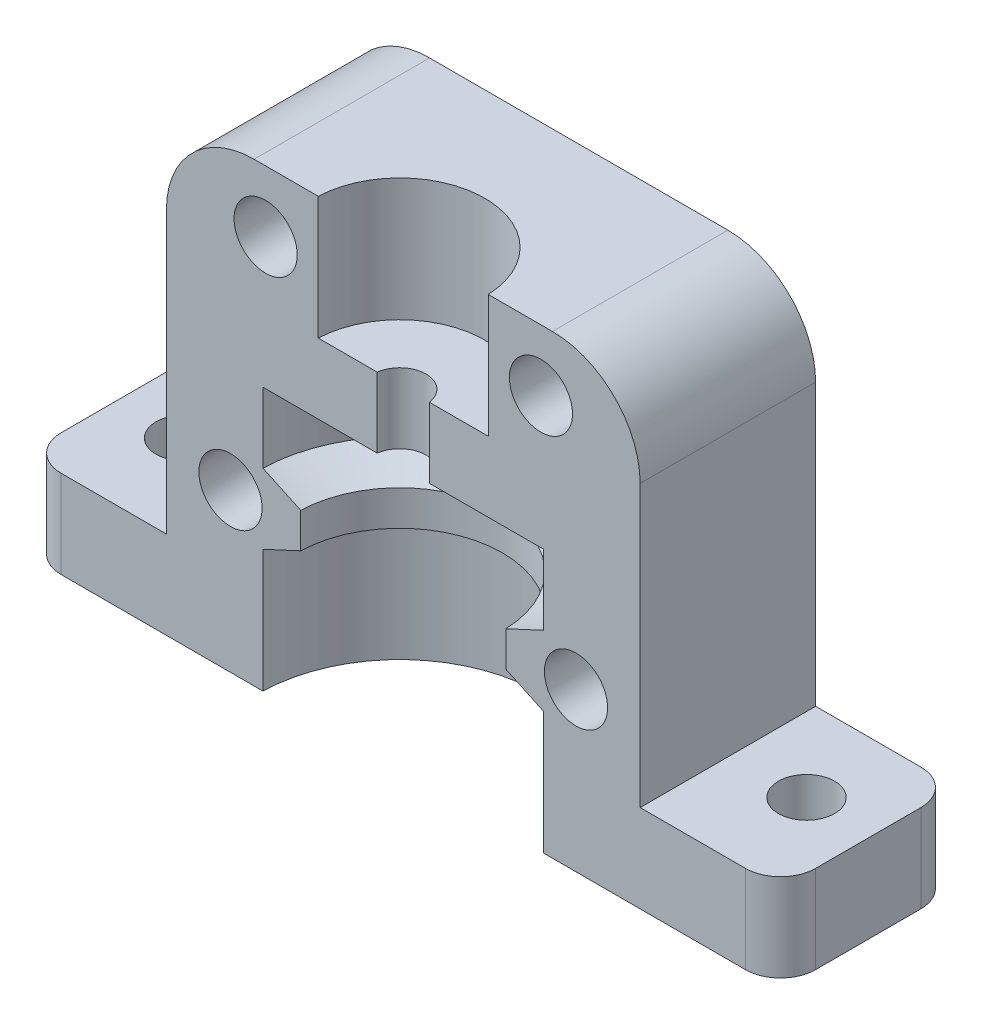
ISO-10303-21;
HEADER;
FILE_DESCRIPTION(('STEP AP214'),'2;1');
FILE_NAME('part.step','',(''),(''),'','','');
FILE_SCHEMA(('AUTOMOTIVE_DESIGN { 1 0 10303 214 1 1 1 1 }'));
ENDSEC;
DATA;
#1=APPLICATION_CONTEXT('core data for automotive mechanical design processes');
#2=APPLICATION_PROTOCOL_DEFINITION('international standard','automotive_design',2000,#1);
#3=PRODUCT_CONTEXT('',#1,'mechanical');
#4=PRODUCT('Part','Part','',(#3));
#5=PRODUCT_RELATED_PRODUCT_CATEGORY('part','',(#4));
#6=PRODUCT_DEFINITION_FORMATION('','',#4);
#7=PRODUCT_DEFINITION_CONTEXT('part definition',#1,'design');
#8=PRODUCT_DEFINITION('design','',#6,#7);
#9=PRODUCT_DEFINITION_SHAPE('','',#8);
#10=(LENGTH_UNIT() NAMED_UNIT(*) SI_UNIT(.MILLI.,.METRE.));
#11=(NAMED_UNIT(*) PLANE_ANGLE_UNIT() SI_UNIT($,.RADIAN.));
#12=(NAMED_UNIT(*) SI_UNIT($,.STERADIAN.) SOLID_ANGLE_UNIT());
#13=UNCERTAINTY_MEASURE_WITH_UNIT(LENGTH_MEASURE(1.E-05),#10,'distance_accuracy_value','');
#14=(GEOMETRIC_REPRESENTATION_CONTEXT(3) GLOBAL_UNCERTAINTY_ASSIGNED_CONTEXT((#13)) GLOBAL_UNIT_ASSIGNED_CONTEXT((#10,
#11,#12)) REPRESENTATION_CONTEXT('',''));
#15=CARTESIAN_POINT('',(0.,0.,0.));
#16=DIRECTION('',(0.,0.,1.));
#17=DIRECTION('',(1.,0.,0.));
#18=AXIS2_PLACEMENT_3D('',#15,#16,#17);
#19=CARTESIAN_POINT('',(-13.5,0.,0.));
#20=DIRECTION('',(0.,1.,0.));
#21=DIRECTION('',(0.,0.,1.));
#22=AXIS2_PLACEMENT_3D('',#19,#20,#21);
#23=PLANE('',#22);
#24=DIRECTION('',(0.,0.,1.));
#25=VECTOR('',#24,1.);
#26=CARTESIAN_POINT('',(-21.5,0.,0.));
#27=LINE('',#26,#25);
#28=CARTESIAN_POINT('',(-21.5,0.,-8.));
#29=VERTEX_POINT('',#28);
#30=CARTESIAN_POINT('',(-21.5,0.,-2.));
#31=VERTEX_POINT('',#30);
#32=EDGE_CURVE('E239',#29,#31,#27,.T.);
#33=ORIENTED_EDGE('',*,*,#32,.F.);
#34=CARTESIAN_POINT('',(-19.5,0.,-8.));
#35=DIRECTION('',(0.,1.,0.));
#36=DIRECTION('',(0.,0.,1.));
#37=AXIS2_PLACEMENT_3D('',#34,#35,#36);
#38=CIRCLE('',#37,2.);
#39=CARTESIAN_POINT('',(-19.5,0.,-10.));
#40=VERTEX_POINT('',#39);
#41=EDGE_CURVE('E305',#29,#40,#38,.F.);
#42=ORIENTED_EDGE('',*,*,#41,.T.);
#43=DIRECTION('',(-1.,0.,0.));
#44=VECTOR('',#43,1.);
#45=CARTESIAN_POINT('',(-13.5,0.,-10.));
#46=LINE('',#45,#44);
#47=CARTESIAN_POINT('',(19.5,0.,-10.));
#48=VERTEX_POINT('',#47);
#49=EDGE_CURVE('E220',#48,#40,#46,.T.);
#50=ORIENTED_EDGE('',*,*,#49,.F.);
#51=CARTESIAN_POINT('',(19.5,0.,-8.));
#52=DIRECTION('',(0.,1.,0.));
#53=DIRECTION('',(0.,0.,1.));
#54=AXIS2_PLACEMENT_3D('',#51,#52,#53);
#55=CIRCLE('',#54,2.);
#56=CARTESIAN_POINT('',(21.5,0.,-8.));
#57=VERTEX_POINT('',#56);
#58=EDGE_CURVE('E304',#48,#57,#55,.F.);
#59=ORIENTED_EDGE('',*,*,#58,.T.);
#60=DIRECTION('',(0.,0.,1.));
#61=VECTOR('',#60,1.);
#62=CARTESIAN_POINT('',(21.5,0.,0.));
#63=LINE('',#62,#61);
#64=CARTESIAN_POINT('',(21.5,0.,-2.));
#65=VERTEX_POINT('',#64);
#66=EDGE_CURVE('E264',#57,#65,#63,.T.);
#67=ORIENTED_EDGE('',*,*,#66,.T.);
#68=CARTESIAN_POINT('',(19.5,0.,-2.));
#69=DIRECTION('',(0.,1.,0.));
#70=DIRECTION('',(0.,0.,1.));
#71=AXIS2_PLACEMENT_3D('',#68,#69,#70);
#72=CIRCLE('',#71,2.);
#73=CARTESIAN_POINT('',(19.5,0.,0.));
#74=VERTEX_POINT('',#73);
#75=EDGE_CURVE('E495',#65,#74,#72,.F.);
#76=ORIENTED_EDGE('',*,*,#75,.T.);
#77=DIRECTION('',(1.,0.,0.));
#78=VECTOR('',#77,1.);
#79=CARTESIAN_POINT('',(-13.5,0.,0.));
#80=LINE('',#79,#78);
#81=CARTESIAN_POINT('',(7.99749960925288,0.,0.));
#82=VERTEX_POINT('',#81);
#83=EDGE_CURVE('E536',#82,#74,#80,.T.);
#84=ORIENTED_EDGE('',*,*,#83,.F.);
#85=CARTESIAN_POINT('',(0.,0.,0.2));
#86=DIRECTION('',(0.,1.,0.));
#87=DIRECTION('',(0.,0.,1.));
#88=AXIS2_PLACEMENT_3D('',#85,#86,#87);
#89=CIRCLE('',#88,8.);
#90=CARTESIAN_POINT('',(-7.99749960925288,0.,0.));
#91=VERTEX_POINT('',#90);
#92=EDGE_CURVE('E546',#82,#91,#89,.T.);
#93=ORIENTED_EDGE('',*,*,#92,.T.);
#94=CARTESIAN_POINT('',(-19.5,0.,0.));
#95=VERTEX_POINT('',#94);
#96=EDGE_CURVE('E535',#95,#91,#80,.T.);
#97=ORIENTED_EDGE('',*,*,#96,.F.);
#98=CARTESIAN_POINT('',(-19.5,0.,-2.));
#99=DIRECTION('',(0.,1.,0.));
#100=DIRECTION('',(0.,0.,1.));
#101=AXIS2_PLACEMENT_3D('',#98,#99,#100);
#102=CIRCLE('',#101,2.);
#103=EDGE_CURVE('E309',#95,#31,#102,.F.);
#104=ORIENTED_EDGE('',*,*,#103,.T.);
#105=EDGE_LOOP('',(#33,#42,#50,#59,#67,#76,#84,#93,#97,#104));
#106=FACE_BOUND('',#105,.T.);
#107=CARTESIAN_POINT('',(17.7373503171622,0.,-5.24426134233362));
#108=DIRECTION('',(0.,-1.,0.));
#109=DIRECTION('',(0.,0.,-1.));
#110=AXIS2_PLACEMENT_3D('',#107,#108,#109);
#111=CIRCLE('',#110,1.60000000000001);
#112=CARTESIAN_POINT('',(17.7373503171622,0.,-6.84426134233363));
#113=VERTEX_POINT('',#112);
#114=EDGE_CURVE('E231',#113,#113,#111,.T.);
#115=ORIENTED_EDGE('',*,*,#114,.F.);
#116=EDGE_LOOP('',(#115));
#117=FACE_BOUND('',#116,.T.);
#118=CARTESIAN_POINT('',(-17.7373503171622,0.,-5.24426134233362));
#119=DIRECTION('',(0.,1.,0.));
#120=DIRECTION('',(0.,0.,-1.));
#121=AXIS2_PLACEMENT_3D('',#118,#119,#120);
#122=CIRCLE('',#121,1.60000000000001);
#123=CARTESIAN_POINT('',(-17.7373503171622,0.,-6.84426134233363));
#124=VERTEX_POINT('',#123);
#125=EDGE_CURVE('E243',#124,#124,#122,.T.);
#126=ORIENTED_EDGE('',*,*,#125,.T.);
#127=EDGE_LOOP('',(#126));
#128=FACE_BOUND('',#127,.T.);
#129=ADVANCED_FACE('F43',(#106,#117,#128),#23,.F.);
#130=CARTESIAN_POINT('',(-13.5,5.,-10.));
#131=DIRECTION('',(0.,-1.,0.));
#132=DIRECTION('',(0.,0.,-1.));
#133=AXIS2_PLACEMENT_3D('',#130,#131,#132);
#134=PLANE('',#133);
#135=DIRECTION('',(-1.,0.,0.));
#136=VECTOR('',#135,1.);
#137=CARTESIAN_POINT('',(-13.5,5.,-10.));
#138=LINE('',#137,#136);
#139=CARTESIAN_POINT('',(-13.5,5.,-10.));
#140=VERTEX_POINT('',#139);
#141=CARTESIAN_POINT('',(-19.5,5.,-10.));
#142=VERTEX_POINT('',#141);
#143=EDGE_CURVE('E223',#140,#142,#138,.T.);
#144=ORIENTED_EDGE('',*,*,#143,.T.);
#145=CARTESIAN_POINT('',(-19.5,5.,-8.));
#146=DIRECTION('',(0.,-1.,0.));
#147=DIRECTION('',(0.,0.,-1.));
#148=AXIS2_PLACEMENT_3D('',#145,#146,#147);
#149=CIRCLE('',#148,2.);
#150=CARTESIAN_POINT('',(-21.5,5.,-8.));
#151=VERTEX_POINT('',#150);
#152=EDGE_CURVE('E314',#142,#151,#149,.F.);
#153=ORIENTED_EDGE('',*,*,#152,.T.);
#154=DIRECTION('',(0.,0.,1.));
#155=VECTOR('',#154,1.);
#156=CARTESIAN_POINT('',(-21.5,5.,0.));
#157=LINE('',#156,#155);
#158=CARTESIAN_POINT('',(-21.5,5.,-2.));
#159=VERTEX_POINT('',#158);
#160=EDGE_CURVE('E232',#151,#159,#157,.T.);
#161=ORIENTED_EDGE('',*,*,#160,.T.);
#162=CARTESIAN_POINT('',(-19.5,5.,-2.));
#163=DIRECTION('',(0.,-1.,0.));
#164=DIRECTION('',(0.,0.,-1.));
#165=AXIS2_PLACEMENT_3D('',#162,#163,#164);
#166=CIRCLE('',#165,2.);
#167=CARTESIAN_POINT('',(-19.5,5.,0.));
#168=VERTEX_POINT('',#167);
#169=EDGE_CURVE('E307',#159,#168,#166,.F.);
#170=ORIENTED_EDGE('',*,*,#169,.T.);
#171=DIRECTION('',(1.,0.,0.));
#172=VECTOR('',#171,1.);
#173=CARTESIAN_POINT('',(-13.5,5.,0.));
#174=LINE('',#173,#172);
#175=CARTESIAN_POINT('',(-13.5,5.,0.));
#176=VERTEX_POINT('',#175);
#177=EDGE_CURVE('E237',#168,#176,#174,.T.);
#178=ORIENTED_EDGE('',*,*,#177,.T.);
#179=DIRECTION('',(0.,0.,-1.));
#180=VECTOR('',#179,1.);
#181=CARTESIAN_POINT('',(-13.5,5.,0.));
#182=LINE('',#181,#180);
#183=EDGE_CURVE('E214',#176,#140,#182,.T.);
#184=ORIENTED_EDGE('',*,*,#183,.T.);
#185=EDGE_LOOP('',(#144,#153,#161,#170,#178,#184));
#186=FACE_BOUND('',#185,.T.);
#187=CARTESIAN_POINT('',(-17.7373503171622,5.,-5.24426134233362));
#188=DIRECTION('',(0.,-1.,0.));
#189=DIRECTION('',(0.,0.,-1.));
#190=AXIS2_PLACEMENT_3D('',#187,#188,#189);
#191=CIRCLE('',#190,1.60000000000001);
#192=CARTESIAN_POINT('',(-17.7373503171622,5.,-6.84426134233363));
#193=VERTEX_POINT('',#192);
#194=EDGE_CURVE('E254',#193,#193,#191,.T.);
#195=ORIENTED_EDGE('',*,*,#194,.T.);
#196=EDGE_LOOP('',(#195));
#197=FACE_BOUND('',#196,.T.);
#198=ADVANCED_FACE('F234',(#186,#197),#134,.F.);
#199=CARTESIAN_POINT('',(-13.5,15.,-10.));
#200=DIRECTION('',(1.,0.,0.));
#201=DIRECTION('',(0.,0.,-1.));
#202=AXIS2_PLACEMENT_3D('',#199,#200,#201);
#203=PLANE('',#202);
#204=DIRECTION('',(0.,-1.,0.));
#205=VECTOR('',#204,1.);
#206=CARTESIAN_POINT('',(-13.5,15.,0.));
#207=LINE('',#206,#205);
#208=CARTESIAN_POINT('',(-13.5,21.,0.));
#209=VERTEX_POINT('',#208);
#210=EDGE_CURVE('E488',#209,#176,#207,.T.);
#211=ORIENTED_EDGE('',*,*,#210,.F.);
#212=DIRECTION('',(0.,0.,1.));
#213=VECTOR('',#212,1.);
#214=CARTESIAN_POINT('',(-13.5,21.,-10.));
#215=LINE('',#214,#213);
#216=CARTESIAN_POINT('',(-13.5,21.,-10.));
#217=VERTEX_POINT('',#216);
#218=EDGE_CURVE('E216',#209,#217,#215,.F.);
#219=ORIENTED_EDGE('',*,*,#218,.T.);
#220=DIRECTION('',(0.,-1.,0.));
#221=VECTOR('',#220,1.);
#222=CARTESIAN_POINT('',(-13.5,15.,-10.));
#223=LINE('',#222,#221);
#224=EDGE_CURVE('E209',#217,#140,#223,.T.);
#225=ORIENTED_EDGE('',*,*,#224,.T.);
#226=ORIENTED_EDGE('',*,*,#183,.F.);
#227=EDGE_LOOP('',(#211,#219,#225,#226));
#228=FACE_BOUND('',#227,.T.);
#229=ADVANCED_FACE('F212',(#228),#203,.F.);
#230=CARTESIAN_POINT('',(-13.5,15.,0.));
#231=DIRECTION('',(0.,0.,-1.));
#232=DIRECTION('',(-1.,0.,0.));
#233=AXIS2_PLACEMENT_3D('',#230,#231,#232);
#234=PLANE('',#233);
#235=CARTESIAN_POINT('',(9.84658019700406,9.,0.));
#236=DIRECTION('',(0.,0.,-1.));
#237=DIRECTION('',(-1.,0.,0.));
#238=AXIS2_PLACEMENT_3D('',#235,#236,#237);
#239=CIRCLE('',#238,1.8);
#240=CARTESIAN_POINT('',(8.04658019700406,9.,0.));
#241=VERTEX_POINT('',#240);
#242=EDGE_CURVE('E397',#241,#241,#239,.T.);
#243=ORIENTED_EDGE('',*,*,#242,.T.);
#244=EDGE_LOOP('',(#243));
#245=FACE_BOUND('',#244,.T.);
#246=ORIENTED_EDGE('',*,*,#83,.T.);
#247=DIRECTION('',(0.,-1.,0.));
#248=VECTOR('',#247,1.);
#249=CARTESIAN_POINT('',(19.5,5.,0.));
#250=LINE('',#249,#248);
#251=CARTESIAN_POINT('',(19.5,5.,0.));
#252=VERTEX_POINT('',#251);
#253=EDGE_CURVE('E12',#74,#252,#250,.F.);
#254=ORIENTED_EDGE('',*,*,#253,.T.);
#255=DIRECTION('',(-1.,0.,0.));
#256=VECTOR('',#255,1.);
#257=CARTESIAN_POINT('',(13.5,5.,0.));
#258=LINE('',#257,#256);
#259=CARTESIAN_POINT('',(13.5,5.,0.));
#260=VERTEX_POINT('',#259);
#261=EDGE_CURVE('E284',#252,#260,#258,.T.);
#262=ORIENTED_EDGE('',*,*,#261,.T.);
#263=DIRECTION('',(0.,-1.,0.));
#264=VECTOR('',#263,1.);
#265=CARTESIAN_POINT('',(13.5,15.,0.));
#266=LINE('',#265,#264);
#267=CARTESIAN_POINT('',(13.5,21.,0.));
#268=VERTEX_POINT('',#267);
#269=EDGE_CURVE('E508',#268,#260,#266,.T.);
#270=ORIENTED_EDGE('',*,*,#269,.F.);
#271=CARTESIAN_POINT('',(8.5,21.,0.));
#272=DIRECTION('',(0.,0.,-1.));
#273=DIRECTION('',(-1.,0.,0.));
#274=AXIS2_PLACEMENT_3D('',#271,#272,#273);
#275=CIRCLE('',#274,5.);
#276=CARTESIAN_POINT('',(8.5,26.,0.));
#277=VERTEX_POINT('',#276);
#278=EDGE_CURVE('E503',#268,#277,#275,.F.);
#279=ORIENTED_EDGE('',*,*,#278,.T.);
#280=DIRECTION('',(1.,0.,0.));
#281=VECTOR('',#280,1.);
#282=CARTESIAN_POINT('',(13.5,26.,0.));
#283=LINE('',#282,#281);
#284=CARTESIAN_POINT('',(4.84587453407535,26.,0.));
#285=VERTEX_POINT('',#284);
#286=EDGE_CURVE('E344',#285,#277,#283,.T.);
#287=ORIENTED_EDGE('',*,*,#286,.F.);
#288=DIRECTION('',(0.,-1.,0.));
#289=VECTOR('',#288,1.);
#290=CARTESIAN_POINT('',(4.84587453407535,26.,0.));
#291=LINE('',#290,#289);
#292=CARTESIAN_POINT('',(4.84587453407535,19.,0.));
#293=VERTEX_POINT('',#292);
#294=EDGE_CURVE('E363',#285,#293,#291,.T.);
#295=ORIENTED_EDGE('',*,*,#294,.T.);
#296=DIRECTION('',(1.,0.,0.));
#297=VECTOR('',#296,1.);
#298=CARTESIAN_POINT('',(13.5,19.,0.));
#299=LINE('',#298,#297);
#300=CARTESIAN_POINT('',(1.48660687473185,19.,0.));
#301=VERTEX_POINT('',#300);
#302=EDGE_CURVE('E378',#301,#293,#299,.T.);
#303=ORIENTED_EDGE('',*,*,#302,.F.);
#304=DIRECTION('',(0.,-1.,0.));
#305=VECTOR('',#304,1.);
#306=CARTESIAN_POINT('',(1.48660687473185,19.,0.));
#307=LINE('',#306,#305);
#308=CARTESIAN_POINT('',(1.48660687473185,15.,0.));
#309=VERTEX_POINT('',#308);
#310=EDGE_CURVE('E400',#301,#309,#307,.T.);
#311=ORIENTED_EDGE('',*,*,#310,.T.);
#312=DIRECTION('',(1.,0.,0.));
#313=VECTOR('',#312,1.);
#314=CARTESIAN_POINT('',(13.5,15.,0.));
#315=LINE('',#314,#313);
#316=CARTESIAN_POINT('',(7.99749960925288,15.,0.));
#317=VERTEX_POINT('',#316);
#318=EDGE_CURVE('E371',#309,#317,#315,.T.);
#319=ORIENTED_EDGE('',*,*,#318,.T.);
#320=DIRECTION('',(0.,1.,0.));
#321=VECTOR('',#320,1.);
#322=CARTESIAN_POINT('',(7.99749960925288,0.,0.));
#323=LINE('',#322,#321);
#324=CARTESIAN_POINT('',(7.99749960925288,11.,0.));
#325=VERTEX_POINT('',#324);
#326=EDGE_CURVE('E545',#317,#325,#323,.F.);
#327=ORIENTED_EDGE('',*,*,#326,.T.);
#328=CARTESIAN_POINT('',(2.13630859371696,8.27704656420469,0.));
#329=CARTESIAN_POINT('',(2.47666423208481,8.43471843957493,0.));
#330=CARTESIAN_POINT('',(2.81694662807883,8.59254819133193,0.));
#331=CARTESIAN_POINT('',(3.49742444253003,8.90839501686628,0.));
#332=CARTESIAN_POINT('',(3.83761986099677,9.06641209062303,0.));
#333=CARTESIAN_POINT('',(4.4960870926516,9.37233230676927,0.));
#334=CARTESIAN_POINT('',(4.81436061243148,9.52023177837934,0.));
#335=CARTESIAN_POINT('',(5.45089092468353,9.81606676258005,0.));
#336=CARTESIAN_POINT('',(5.76914771715483,9.96400227517255,0.));
#337=CARTESIAN_POINT('',(7.10500578331535,10.5849946663086,0.));
#338=CARTESIAN_POINT('',(8.12256957669212,11.0581321615499,0.));
#339=CARTESIAN_POINT('',(10.1576644379378,12.0044770489123,0.));
#340=CARTESIAN_POINT('',(11.1751955058127,12.4776844410207,0.));
#341=CARTESIAN_POINT('',(12.1927355761452,12.9508724589787,0.));
#342=B_SPLINE_CURVE_WITH_KNOTS('',3,(#328,#329,#330,#331,#332,#333,#334,#335,#336,#337,#338,
#339,#340,#341),.UNSPECIFIED.,.F.,.F.,(4,2,2,2,2,2,4),(0.,1.12530931068258,2.25061849754615,
3.3034957911826,4.35637313909035,7.72292277313432,11.0894717975949),.UNSPECIFIED.);
#343=CARTESIAN_POINT('',(5.84658019700406,10.,0.));
#344=VERTEX_POINT('',#343);
#345=EDGE_CURVE('E413',#344,#325,#342,.T.);
#346=ORIENTED_EDGE('',*,*,#345,.F.);
#347=DIRECTION('',(0.,1.,0.));
#348=VECTOR('',#347,1.);
#349=CARTESIAN_POINT('',(5.84658019700406,8.,0.));
#350=LINE('',#349,#348);
#351=CARTESIAN_POINT('',(5.84658019700406,8.,0.));
#352=VERTEX_POINT('',#351);
#353=EDGE_CURVE('E557',#352,#344,#350,.T.);
#354=ORIENTED_EDGE('',*,*,#353,.F.);
#355=CARTESIAN_POINT('',(12.1927355761452,5.04912754102129,0.));
#356=CARTESIAN_POINT('',(11.1751953427723,5.5223155470782,0.));
#357=CARTESIAN_POINT('',(10.1576641621358,5.99552303548821,0.));
#358=CARTESIAN_POINT('',(8.12256933439907,6.94186799496408,0.));
#359=CARTESIAN_POINT('',(7.1050056873013,7.41500546603509,0.));
#360=CARTESIAN_POINT('',(5.75820074929095,8.0410865482715,0.));
#361=CARTESIAN_POINT('',(5.42899669934764,8.19411026138158,0.));
#362=CARTESIAN_POINT('',(4.77057050907102,8.50011873165198,0.));
#363=CARTESIAN_POINT('',(4.44134836873824,8.65310348881343,0.));
#364=CARTESIAN_POINT('',(3.78287676360594,8.95901430342748,0.));
#365=CARTESIAN_POINT('',(3.45362729880392,9.11194036087472,0.));
#366=CARTESIAN_POINT('',(2.79504473693981,9.41761235203759,0.));
#367=CARTESIAN_POINT('',(2.46571163986858,9.57035828573351,0.));
#368=CARTESIAN_POINT('',(2.13630859371698,9.7229534357953,0.));
#369=B_SPLINE_CURVE_WITH_KNOTS('',3,(#355,#356,#357,#358,#359,#360,#361,#362,#363,#364,#365,
#366,#367,#368),.UNSPECIFIED.,.F.,.F.,(4,2,2,2,2,2,4),(0.,3.36654945298723,6.73309865850457,
7.8221918877661,8.91128508569589,10.0003783832144,11.0894717998489),.UNSPECIFIED.);
#370=CARTESIAN_POINT('',(7.99749960925288,7.,0.));
#371=VERTEX_POINT('',#370);
#372=EDGE_CURVE('E404',#371,#352,#369,.T.);
#373=ORIENTED_EDGE('',*,*,#372,.F.);
#374=EDGE_CURVE('E541',#371,#82,#323,.F.);
#375=ORIENTED_EDGE('',*,*,#374,.T.);
#376=EDGE_LOOP('',(#246,#254,#262,#270,#279,#287,#295,#303,#311,#319,#327,#346,#354,#373,#375));
#377=FACE_BOUND('',#376,.T.);
#378=CARTESIAN_POINT('',(7.84587453407535,22.5,0.));
#379=DIRECTION('',(0.,0.,-1.));
#380=DIRECTION('',(-1.,0.,0.));
#381=AXIS2_PLACEMENT_3D('',#378,#379,#380);
#382=CIRCLE('',#381,1.8);
#383=CARTESIAN_POINT('',(6.04587453407535,22.5,0.));
#384=VERTEX_POINT('',#383);
#385=EDGE_CURVE('E288',#384,#384,#382,.T.);
#386=ORIENTED_EDGE('',*,*,#385,.T.);
#387=EDGE_LOOP('',(#386));
#388=FACE_BOUND('',#387,.T.);
#389=ADVANCED_FACE('F421',(#245,#377,#388),#234,.F.);
#390=CARTESIAN_POINT('',(-13.5,15.,-10.));
#391=DIRECTION('',(0.,0.,1.));
#392=DIRECTION('',(1.,0.,0.));
#393=AXIS2_PLACEMENT_3D('',#390,#391,#392);
#394=PLANE('',#393);
#395=CARTESIAN_POINT('',(9.84658019700406,9.,-10.));
#396=DIRECTION('',(0.,0.,-1.));
#397=DIRECTION('',(-1.,0.,0.));
#398=AXIS2_PLACEMENT_3D('',#395,#396,#397);
#399=CIRCLE('',#398,1.8);
#400=CARTESIAN_POINT('',(8.04658019700406,9.,-10.));
#401=VERTEX_POINT('',#400);
#402=EDGE_CURVE('E393',#401,#401,#399,.T.);
#403=ORIENTED_EDGE('',*,*,#402,.F.);
#404=EDGE_LOOP('',(#403));
#405=FACE_BOUND('',#404,.T.);
#406=CARTESIAN_POINT('',(-9.84658019700406,9.,-10.));
#407=DIRECTION('',(0.,0.,1.));
#408=DIRECTION('',(1.,0.,0.));
#409=AXIS2_PLACEMENT_3D('',#406,#407,#408);
#410=CIRCLE('',#409,1.8);
#411=CARTESIAN_POINT('',(-8.04658019700406,9.,-10.));
#412=VERTEX_POINT('',#411);
#413=EDGE_CURVE('E401',#412,#412,#410,.T.);
#414=ORIENTED_EDGE('',*,*,#413,.T.);
#415=EDGE_LOOP('',(#414));
#416=FACE_BOUND('',#415,.T.);
#417=ORIENTED_EDGE('',*,*,#49,.T.);
#418=DIRECTION('',(0.,-1.,0.));
#419=VECTOR('',#418,1.);
#420=CARTESIAN_POINT('',(-19.5,15.,-10.));
#421=LINE('',#420,#419);
#422=EDGE_CURVE('E228',#40,#142,#421,.F.);
#423=ORIENTED_EDGE('',*,*,#422,.T.);
#424=ORIENTED_EDGE('',*,*,#143,.F.);
#425=ORIENTED_EDGE('',*,*,#224,.F.);
#426=CARTESIAN_POINT('',(-8.5,21.,-10.));
#427=DIRECTION('',(0.,0.,1.));
#428=DIRECTION('',(1.,0.,0.));
#429=AXIS2_PLACEMENT_3D('',#426,#427,#428);
#430=CIRCLE('',#429,5.);
#431=CARTESIAN_POINT('',(-8.5,26.,-10.));
#432=VERTEX_POINT('',#431);
#433=EDGE_CURVE('E507',#217,#432,#430,.F.);
#434=ORIENTED_EDGE('',*,*,#433,.T.);
#435=DIRECTION('',(-1.,0.,0.));
#436=VECTOR('',#435,1.);
#437=CARTESIAN_POINT('',(-13.5,26.,-10.));
#438=LINE('',#437,#436);
#439=CARTESIAN_POINT('',(8.5,26.,-10.));
#440=VERTEX_POINT('',#439);
#441=EDGE_CURVE('E347',#440,#432,#438,.T.);
#442=ORIENTED_EDGE('',*,*,#441,.F.);
#443=CARTESIAN_POINT('',(8.5,21.,-10.));
#444=DIRECTION('',(0.,0.,1.));
#445=DIRECTION('',(1.,0.,0.));
#446=AXIS2_PLACEMENT_3D('',#443,#444,#445);
#447=CIRCLE('',#446,5.);
#448=CARTESIAN_POINT('',(13.5,21.,-10.));
#449=VERTEX_POINT('',#448);
#450=EDGE_CURVE('E605',#440,#449,#447,.F.);
#451=ORIENTED_EDGE('',*,*,#450,.T.);
#452=DIRECTION('',(0.,-1.,0.));
#453=VECTOR('',#452,1.);
#454=CARTESIAN_POINT('',(13.5,15.,-10.));
#455=LINE('',#454,#453);
#456=CARTESIAN_POINT('',(13.5,5.,-10.));
#457=VERTEX_POINT('',#456);
#458=EDGE_CURVE('E219',#449,#457,#455,.T.);
#459=ORIENTED_EDGE('',*,*,#458,.T.);
#460=DIRECTION('',(1.,0.,0.));
#461=VECTOR('',#460,1.);
#462=CARTESIAN_POINT('',(13.5,5.,-10.));
#463=LINE('',#462,#461);
#464=CARTESIAN_POINT('',(19.5,5.,-10.));
#465=VERTEX_POINT('',#464);
#466=EDGE_CURVE('E275',#457,#465,#463,.T.);
#467=ORIENTED_EDGE('',*,*,#466,.T.);
#468=DIRECTION('',(0.,-1.,0.));
#469=VECTOR('',#468,1.);
#470=CARTESIAN_POINT('',(19.5,0.,-10.));
#471=LINE('',#470,#469);
#472=EDGE_CURVE('E300',#465,#48,#471,.T.);
#473=ORIENTED_EDGE('',*,*,#472,.T.);
#474=EDGE_LOOP('',(#417,#423,#424,#425,#434,#442,#451,#459,#467,#473));
#475=FACE_BOUND('',#474,.T.);
#476=CARTESIAN_POINT('',(-7.84587453407535,22.5,-10.));
#477=DIRECTION('',(0.,0.,1.));
#478=DIRECTION('',(1.,0.,0.));
#479=AXIS2_PLACEMENT_3D('',#476,#477,#478);
#480=CIRCLE('',#479,1.8);
#481=CARTESIAN_POINT('',(-6.04587453407535,22.5,-10.));
#482=VERTEX_POINT('',#481);
#483=EDGE_CURVE('E335',#482,#482,#480,.T.);
#484=ORIENTED_EDGE('',*,*,#483,.T.);
#485=EDGE_LOOP('',(#484));
#486=FACE_BOUND('',#485,.T.);
#487=CARTESIAN_POINT('',(7.84587453407535,22.5,-10.));
#488=DIRECTION('',(0.,0.,-1.));
#489=DIRECTION('',(-1.,0.,0.));
#490=AXIS2_PLACEMENT_3D('',#487,#488,#489);
#491=CIRCLE('',#490,1.8);
#492=CARTESIAN_POINT('',(6.04587453407535,22.5,-10.));
#493=VERTEX_POINT('',#492);
#494=EDGE_CURVE('E329',#493,#493,#491,.T.);
#495=ORIENTED_EDGE('',*,*,#494,.F.);
#496=EDGE_LOOP('',(#495));
#497=FACE_BOUND('',#496,.T.);
#498=ADVANCED_FACE('F225',(#405,#416,#475,#486,#497),#394,.F.);
#499=CARTESIAN_POINT('',(0.,19.,0.200000000000001));
#500=DIRECTION('',(0.,-1.,0.));
#501=DIRECTION('',(0.,0.,-1.));
#502=AXIS2_PLACEMENT_3D('',#499,#500,#501);
#503=PLANE('',#502);
#504=CARTESIAN_POINT('',(0.,19.,0.200000000000001));
#505=DIRECTION('',(0.,-1.,0.));
#506=DIRECTION('',(0.,0.,-1.));
#507=AXIS2_PLACEMENT_3D('',#504,#505,#506);
#508=CIRCLE('',#507,4.85);
#509=CARTESIAN_POINT('',(-4.84587453407535,19.,0.));
#510=VERTEX_POINT('',#509);
#511=EDGE_CURVE('E338',#510,#293,#508,.T.);
#512=ORIENTED_EDGE('',*,*,#511,.F.);
#513=DIRECTION('',(1.,0.,0.));
#514=VECTOR('',#513,1.);
#515=CARTESIAN_POINT('',(-1.48660687473185,19.,0.));
#516=LINE('',#515,#514);
#517=CARTESIAN_POINT('',(-1.48660687473185,19.,0.));
#518=VERTEX_POINT('',#517);
#519=EDGE_CURVE('E374',#510,#518,#516,.T.);
#520=ORIENTED_EDGE('',*,*,#519,.T.);
#521=CARTESIAN_POINT('',(0.,19.,0.200000000000001));
#522=DIRECTION('',(0.,-1.,0.));
#523=DIRECTION('',(0.,0.,-1.));
#524=AXIS2_PLACEMENT_3D('',#521,#522,#523);
#525=CIRCLE('',#524,1.5);
#526=EDGE_CURVE('E355',#518,#301,#525,.T.);
#527=ORIENTED_EDGE('',*,*,#526,.T.);
#528=ORIENTED_EDGE('',*,*,#302,.T.);
#529=EDGE_LOOP('',(#512,#520,#527,#528));
#530=FACE_BOUND('',#529,.T.);
#531=ADVANCED_FACE('F466',(#530),#503,.F.);
#532=CARTESIAN_POINT('',(0.,0.,0.2));
#533=DIRECTION('',(0.,1.,0.));
#534=DIRECTION('',(0.,0.,1.));
#535=AXIS2_PLACEMENT_3D('',#532,#533,#534);
#536=CYLINDRICAL_SURFACE('',#535,8.);
#537=DIRECTION('',(0.,1.,0.));
#538=VECTOR('',#537,1.);
#539=CARTESIAN_POINT('',(-7.99749960925288,0.,0.));
#540=LINE('',#539,#538);
#541=CARTESIAN_POINT('',(-7.99749960925288,11.,0.));
#542=VERTEX_POINT('',#541);
#543=CARTESIAN_POINT('',(-7.99749960925288,15.,0.));
#544=VERTEX_POINT('',#543);
#545=EDGE_CURVE('E521',#542,#544,#540,.T.);
#546=ORIENTED_EDGE('',*,*,#545,.F.);
#547=CARTESIAN_POINT('',(0.,11.,0.200000000000001));
#548=DIRECTION('',(0.,-1.,0.));
#549=DIRECTION('',(0.,0.,-1.));
#550=AXIS2_PLACEMENT_3D('',#547,#548,#549);
#551=CIRCLE('',#550,8.);
#552=EDGE_CURVE('E446',#542,#325,#551,.T.);
#553=ORIENTED_EDGE('',*,*,#552,.T.);
#554=ORIENTED_EDGE('',*,*,#326,.F.);
#555=CARTESIAN_POINT('',(0.,15.,0.200000000000001));
#556=DIRECTION('',(0.,1.,0.));
#557=DIRECTION('',(0.,0.,1.));
#558=AXIS2_PLACEMENT_3D('',#555,#556,#557);
#559=CIRCLE('',#558,8.);
#560=EDGE_CURVE('E550',#317,#544,#559,.T.);
#561=ORIENTED_EDGE('',*,*,#560,.T.);
#562=EDGE_LOOP('',(#546,#553,#554,#561));
#563=FACE_BOUND('',#562,.T.);
#564=ADVANCED_FACE('F463',(#563),#536,.F.);
#565=CARTESIAN_POINT('',(-7.84587453407535,22.5,0.));
#566=DIRECTION('',(0.,0.,1.));
#567=DIRECTION('',(1.,0.,0.));
#568=AXIS2_PLACEMENT_3D('',#565,#566,#567);
#569=CIRCLE('',#568,1.8);
#570=CARTESIAN_POINT('',(-6.04587453407535,22.5,0.));
#571=VERTEX_POINT('',#570);
#572=EDGE_CURVE('E332',#571,#571,#569,.T.);
#573=ORIENTED_EDGE('',*,*,#572,.F.);
#574=EDGE_LOOP('',(#573));
#575=FACE_BOUND('',#574,.T.);
#576=CARTESIAN_POINT('',(-9.84658019700406,9.,0.));
#577=DIRECTION('',(0.,0.,1.));
#578=DIRECTION('',(1.,0.,0.));
#579=AXIS2_PLACEMENT_3D('',#576,#577,#578);
#580=CIRCLE('',#579,1.8);
#581=CARTESIAN_POINT('',(-8.04658019700406,9.,0.));
#582=VERTEX_POINT('',#581);
#583=EDGE_CURVE('E396',#582,#582,#580,.T.);
#584=ORIENTED_EDGE('',*,*,#583,.F.);
#585=EDGE_LOOP('',(#584));
#586=FACE_BOUND('',#585,.T.);
#587=ORIENTED_EDGE('',*,*,#177,.F.);
#588=DIRECTION('',(0.,-1.,0.));
#589=VECTOR('',#588,1.);
#590=CARTESIAN_POINT('',(-19.5,15.,0.));
#591=LINE('',#590,#589);
#592=EDGE_CURVE('E316',#168,#95,#591,.T.);
#593=ORIENTED_EDGE('',*,*,#592,.T.);
#594=ORIENTED_EDGE('',*,*,#96,.T.);
#595=CARTESIAN_POINT('',(-7.99749960925288,7.,0.));
#596=VERTEX_POINT('',#595);
#597=EDGE_CURVE('E537',#91,#596,#540,.T.);
#598=ORIENTED_EDGE('',*,*,#597,.T.);
#599=CARTESIAN_POINT('',(-13.5694710976632,4.40886283050069,0.));
#600=CARTESIAN_POINT('',(-13.0607075623458,4.64547104003702,0.));
#601=CARTESIAN_POINT('',(-12.5519431312939,4.88207732367614,0.));
#602=CARTESIAN_POINT('',(-11.5344110769824,5.35528297306801,0.));
#603=CARTESIAN_POINT('',(-11.0256434537229,5.59188233882104,0.));
#604=CARTESIAN_POINT('',(-10.0081036317402,6.0650710782205,0.));
#605=CARTESIAN_POINT('',(-9.49933143301761,6.30166045186808,0.));
#606=CARTESIAN_POINT('',(-8.481779674769,6.77482342219577,0.));
#607=CARTESIAN_POINT('',(-7.97300011524274,7.01139701887525,0.));
#608=CARTESIAN_POINT('',(-6.95542795403731,7.48451646442214,0.));
#609=CARTESIAN_POINT('',(-6.44663535235521,7.72106231328321,0.));
#610=CARTESIAN_POINT('',(-5.42902616974135,8.19410230095601,0.));
#611=CARTESIAN_POINT('',(-4.920209588812,8.43059643977289,0.));
#612=CARTESIAN_POINT('',(-4.15693951038571,8.78524064845345,0.));
#613=CARTESIAN_POINT('',(-3.90250856147982,8.9034392435928,0.));
#614=CARTESIAN_POINT('',(-3.39361926921941,9.13977734977291,0.));
#615=CARTESIAN_POINT('',(-3.13916092586904,9.25791686082263,0.));
#616=CARTESIAN_POINT('',(-2.63019130681356,9.49408221653571,0.));
#617=CARTESIAN_POINT('',(-2.37568003107938,9.61210806113644,0.));
#618=CARTESIAN_POINT('',(-1.99381601002154,9.78893745506795,0.));
#619=CARTESIAN_POINT('',(-1.86651178190087,9.84784570774863,0.));
#620=CARTESIAN_POINT('',(-1.61183587592353,9.96551636455164,0.));
#621=CARTESIAN_POINT('',(-1.48446419803226,10.024278768599,0.));
#622=CARTESIAN_POINT('',(-1.35704130817498,10.0829301949044,0.));
#623=B_SPLINE_CURVE_WITH_KNOTS('',3,(#599,#600,#601,#602,#603,#604,#605,#606,#607,#608,#609,
#610,#611,#612,#613,#614,#615,#616,#617,#618,#619,#620,#621,#622),.UNSPECIFIED.,.F.,.F.,(4,2,2,
2,2,2,2,2,2,2,2,4),(0.,1.68327478966497,3.366549511425,5.04982403953433,6.73309863361752,
8.41637361127464,10.0996484211946,10.9412861894982,11.7829238302033,12.6245619343962,
13.0453812278782,13.4662007375097),.UNSPECIFIED.);
#624=CARTESIAN_POINT('',(-5.84658019700406,8.,0.));
#625=VERTEX_POINT('',#624);
#626=EDGE_CURVE('E440',#596,#625,#623,.T.);
#627=ORIENTED_EDGE('',*,*,#626,.T.);
#628=DIRECTION('',(0.,1.,0.));
#629=VECTOR('',#628,1.);
#630=CARTESIAN_POINT('',(-5.84658019700406,8.,0.));
#631=LINE('',#630,#629);
#632=CARTESIAN_POINT('',(-5.84658019700406,10.,0.));
#633=VERTEX_POINT('',#632);
#634=EDGE_CURVE('E552',#625,#633,#631,.T.);
#635=ORIENTED_EDGE('',*,*,#634,.T.);
#636=CARTESIAN_POINT('',(-1.35704130817498,7.91706980509557,0.));
#637=CARTESIAN_POINT('',(-1.46595975829712,7.96719943468217,0.));
#638=CARTESIAN_POINT('',(-1.57483882299266,8.01741445097508,0.));
#639=CARTESIAN_POINT('',(-1.79254329865238,8.11796053959665,0.));
#640=CARTESIAN_POINT('',(-1.90136870964311,8.16829161186781,0.));
#641=CARTESIAN_POINT('',(-2.2278021905029,8.31937686088671,0.));
#642=CARTESIAN_POINT('',(-2.44536761730344,8.42022312016,0.));
#643=CARTESIAN_POINT('',(-3.06314649128176,8.70675368077935,0.));
#644=CARTESIAN_POINT('',(-3.46330325335294,8.89256014734099,0.));
#645=CARTESIAN_POINT('',(-4.26356520752686,9.26428404638546,0.));
#646=CARTESIAN_POINT('',(-4.66367039962976,9.45020147886794,0.));
#647=CARTESIAN_POINT('',(-5.86395037453705,10.0080321355048,0.));
#648=CARTESIAN_POINT('',(-6.66408888555472,10.3800234074987,0.));
#649=CARTESIAN_POINT('',(-8.48178572627477,11.2251653310499,0.));
#650=CARTESIAN_POINT('',(-9.49933584227692,11.6983336434773,0.));
#651=CARTESIAN_POINT('',(-11.5344140755056,12.6447142565933,0.));
#652=CARTESIAN_POINT('',(-12.551942192758,13.1179265572263,0.));
#653=CARTESIAN_POINT('',(-13.5694710976632,13.5911371694993,0.));
#654=B_SPLINE_CURVE_WITH_KNOTS('',3,(#636,#637,#638,#639,#640,#641,#642,#643,#644,#645,#646,
#647,#648,#649,#650,#651,#652,#653),.UNSPECIFIED.,.F.,.F.,(4,2,2,2,2,2,2,2,4),(0.,
0.35970233647756,0.719404494770601,1.43880845107362,2.76238131368953,4.08595417223746,
6.73310210680843,10.0996535222429,13.4662007398885),.UNSPECIFIED.);
#655=EDGE_CURVE('E435',#633,#542,#654,.T.);
#656=ORIENTED_EDGE('',*,*,#655,.T.);
#657=ORIENTED_EDGE('',*,*,#545,.T.);
#658=DIRECTION('',(1.,0.,0.));
#659=VECTOR('',#658,1.);
#660=CARTESIAN_POINT('',(-1.48660687473185,15.,0.));
#661=LINE('',#660,#659);
#662=CARTESIAN_POINT('',(-1.48660687473185,15.,0.));
#663=VERTEX_POINT('',#662);
#664=EDGE_CURVE('E391',#544,#663,#661,.T.);
#665=ORIENTED_EDGE('',*,*,#664,.T.);
#666=DIRECTION('',(0.,-1.,0.));
#667=VECTOR('',#666,1.);
#668=CARTESIAN_POINT('',(-1.48660687473185,19.,0.));
#669=LINE('',#668,#667);
#670=EDGE_CURVE('E377',#518,#663,#669,.T.);
#671=ORIENTED_EDGE('',*,*,#670,.F.);
#672=ORIENTED_EDGE('',*,*,#519,.F.);
#673=DIRECTION('',(0.,-1.,0.));
#674=VECTOR('',#673,1.);
#675=CARTESIAN_POINT('',(-4.84587453407535,26.,0.));
#676=LINE('',#675,#674);
#677=CARTESIAN_POINT('',(-4.84587453407535,26.,0.));
#678=VERTEX_POINT('',#677);
#679=EDGE_CURVE('E352',#678,#510,#676,.T.);
#680=ORIENTED_EDGE('',*,*,#679,.F.);
#681=DIRECTION('',(1.,0.,0.));
#682=VECTOR('',#681,1.);
#683=CARTESIAN_POINT('',(-4.84587453407535,26.,0.));
#684=LINE('',#683,#682);
#685=CARTESIAN_POINT('',(-8.5,26.,0.));
#686=VERTEX_POINT('',#685);
#687=EDGE_CURVE('E350',#686,#678,#684,.T.);
#688=ORIENTED_EDGE('',*,*,#687,.F.);
#689=CARTESIAN_POINT('',(-8.5,21.,0.));
#690=DIRECTION('',(0.,0.,-1.));
#691=DIRECTION('',(-1.,0.,0.));
#692=AXIS2_PLACEMENT_3D('',#689,#690,#691);
#693=CIRCLE('',#692,5.);
#694=EDGE_CURVE('E529',#686,#209,#693,.F.);
#695=ORIENTED_EDGE('',*,*,#694,.T.);
#696=ORIENTED_EDGE('',*,*,#210,.T.);
#697=EDGE_LOOP('',(#587,#593,#594,#598,#627,#635,#656,#657,#665,#671,#672,#680,#688,#695,#696));
#698=FACE_BOUND('',#697,.T.);
#699=ADVANCED_FACE('F427',(#575,#586,#698),#234,.F.);
#700=CARTESIAN_POINT('',(13.5,15.,-10.));
#701=DIRECTION('',(-1.,0.,0.));
#702=DIRECTION('',(0.,0.,1.));
#703=AXIS2_PLACEMENT_3D('',#700,#701,#702);
#704=PLANE('',#703);
#705=ORIENTED_EDGE('',*,*,#458,.F.);
#706=DIRECTION('',(0.,0.,-1.));
#707=VECTOR('',#706,1.);
#708=CARTESIAN_POINT('',(13.5,21.,-10.));
#709=LINE('',#708,#707);
#710=EDGE_CURVE('E505',#449,#268,#709,.F.);
#711=ORIENTED_EDGE('',*,*,#710,.T.);
#712=ORIENTED_EDGE('',*,*,#269,.T.);
#713=DIRECTION('',(0.,0.,-1.));
#714=VECTOR('',#713,1.);
#715=CARTESIAN_POINT('',(13.5,5.,0.));
#716=LINE('',#715,#714);
#717=EDGE_CURVE('E270',#260,#457,#716,.T.);
#718=ORIENTED_EDGE('',*,*,#717,.T.);
#719=EDGE_LOOP('',(#705,#711,#712,#718));
#720=FACE_BOUND('',#719,.T.);
#721=ADVANCED_FACE('F428',(#720),#704,.F.);
#722=ORIENTED_EDGE('',*,*,#374,.F.);
#723=CARTESIAN_POINT('',(0.,7.,0.200000000000001));
#724=DIRECTION('',(0.,-1.,0.));
#725=DIRECTION('',(0.,0.,-1.));
#726=AXIS2_PLACEMENT_3D('',#723,#724,#725);
#727=CIRCLE('',#726,8.);
#728=EDGE_CURVE('E570',#596,#371,#727,.T.);
#729=ORIENTED_EDGE('',*,*,#728,.F.);
#730=ORIENTED_EDGE('',*,*,#597,.F.);
#731=ORIENTED_EDGE('',*,*,#92,.F.);
#732=EDGE_LOOP('',(#722,#729,#730,#731));
#733=FACE_BOUND('',#732,.T.);
#734=ADVANCED_FACE('F458',(#733),#536,.F.);
#735=CARTESIAN_POINT('',(0.,8.,0.200000000000001));
#736=DIRECTION('',(0.,1.,0.));
#737=DIRECTION('',(0.,0.,1.));
#738=AXIS2_PLACEMENT_3D('',#735,#736,#737);
#739=CYLINDRICAL_SURFACE('',#738,5.85);
#740=CARTESIAN_POINT('',(0.,10.,0.200000000000001));
#741=DIRECTION('',(0.,-1.,0.));
#742=DIRECTION('',(0.,0.,-1.));
#743=AXIS2_PLACEMENT_3D('',#740,#741,#742);
#744=CIRCLE('',#743,5.85);
#745=EDGE_CURVE('E565',#633,#344,#744,.T.);
#746=ORIENTED_EDGE('',*,*,#745,.F.);
#747=ORIENTED_EDGE('',*,*,#634,.F.);
#748=CARTESIAN_POINT('',(0.,8.,0.200000000000001));
#749=DIRECTION('',(0.,-1.,0.));
#750=DIRECTION('',(0.,0.,-1.));
#751=AXIS2_PLACEMENT_3D('',#748,#749,#750);
#752=CIRCLE('',#751,5.85);
#753=EDGE_CURVE('E562',#625,#352,#752,.T.);
#754=ORIENTED_EDGE('',*,*,#753,.T.);
#755=ORIENTED_EDGE('',*,*,#353,.T.);
#756=EDGE_LOOP('',(#746,#747,#754,#755));
#757=FACE_BOUND('',#756,.T.);
#758=ADVANCED_FACE('F455',(#757),#739,.F.);
#759=CARTESIAN_POINT('',(0.,11.,0.200000000000001));
#760=DIRECTION('',(0.,1.,0.));
#761=DIRECTION('',(0.,0.,1.));
#762=AXIS2_PLACEMENT_3D('',#759,#760,#761);
#763=CONICAL_SURFACE('',#762,8.,1.13544305164259);
#764=ORIENTED_EDGE('',*,*,#655,.F.);
#765=ORIENTED_EDGE('',*,*,#745,.T.);
#766=ORIENTED_EDGE('',*,*,#345,.T.);
#767=ORIENTED_EDGE('',*,*,#552,.F.);
#768=EDGE_LOOP('',(#764,#765,#766,#767));
#769=FACE_BOUND('',#768,.T.);
#770=ADVANCED_FACE('F452',(#769),#763,.F.);
#771=CARTESIAN_POINT('',(0.,8.,0.200000000000001));
#772=DIRECTION('',(0.,-1.,0.));
#773=DIRECTION('',(0.,0.,-1.));
#774=AXIS2_PLACEMENT_3D('',#771,#772,#773);
#775=CONICAL_SURFACE('',#774,5.85,1.1354430516426);
#776=ORIENTED_EDGE('',*,*,#626,.F.);
#777=ORIENTED_EDGE('',*,*,#728,.T.);
#778=ORIENTED_EDGE('',*,*,#372,.T.);
#779=ORIENTED_EDGE('',*,*,#753,.F.);
#780=EDGE_LOOP('',(#776,#777,#778,#779));
#781=FACE_BOUND('',#780,.T.);
#782=ADVANCED_FACE('F447',(#781),#775,.F.);
#783=CARTESIAN_POINT('',(-9.84658019700406,9.,-10.));
#784=DIRECTION('',(0.,0.,1.));
#785=DIRECTION('',(1.,0.,0.));
#786=AXIS2_PLACEMENT_3D('',#783,#784,#785);
#787=CYLINDRICAL_SURFACE('',#786,1.8);
#788=ORIENTED_EDGE('',*,*,#413,.F.);
#789=EDGE_LOOP('',(#788));
#790=FACE_BOUND('',#789,.T.);
#791=ORIENTED_EDGE('',*,*,#583,.T.);
#792=EDGE_LOOP('',(#791));
#793=FACE_BOUND('',#792,.T.);
#794=ADVANCED_FACE('F451',(#790,#793),#787,.F.);
#795=CARTESIAN_POINT('',(9.84658019700406,9.,-10.));
#796=DIRECTION('',(0.,0.,1.));
#797=DIRECTION('',(1.,0.,0.));
#798=AXIS2_PLACEMENT_3D('',#795,#796,#797);
#799=CYLINDRICAL_SURFACE('',#798,1.8);
#800=ORIENTED_EDGE('',*,*,#402,.T.);
#801=EDGE_LOOP('',(#800));
#802=FACE_BOUND('',#801,.T.);
#803=ORIENTED_EDGE('',*,*,#242,.F.);
#804=EDGE_LOOP('',(#803));
#805=FACE_BOUND('',#804,.T.);
#806=ADVANCED_FACE('F479',(#802,#805),#799,.F.);
#807=CARTESIAN_POINT('',(0.,15.,0.200000000000001));
#808=DIRECTION('',(0.,-1.,0.));
#809=DIRECTION('',(0.,0.,-1.));
#810=AXIS2_PLACEMENT_3D('',#807,#808,#809);
#811=PLANE('',#810);
#812=ORIENTED_EDGE('',*,*,#560,.F.);
#813=ORIENTED_EDGE('',*,*,#318,.F.);
#814=CARTESIAN_POINT('',(0.,15.,0.200000000000001));
#815=DIRECTION('',(0.,-1.,0.));
#816=DIRECTION('',(0.,0.,-1.));
#817=AXIS2_PLACEMENT_3D('',#814,#815,#816);
#818=CIRCLE('',#817,1.5);
#819=EDGE_CURVE('E368',#663,#309,#818,.T.);
#820=ORIENTED_EDGE('',*,*,#819,.F.);
#821=ORIENTED_EDGE('',*,*,#664,.F.);
#822=EDGE_LOOP('',(#812,#813,#820,#821));
#823=FACE_BOUND('',#822,.T.);
#824=ADVANCED_FACE('F592',(#823),#811,.T.);
#825=CARTESIAN_POINT('',(0.,19.,0.200000000000001));
#826=DIRECTION('',(0.,-1.,0.));
#827=DIRECTION('',(0.,0.,-1.));
#828=AXIS2_PLACEMENT_3D('',#825,#826,#827);
#829=CYLINDRICAL_SURFACE('',#828,1.5);
#830=ORIENTED_EDGE('',*,*,#819,.T.);
#831=ORIENTED_EDGE('',*,*,#310,.F.);
#832=ORIENTED_EDGE('',*,*,#526,.F.);
#833=ORIENTED_EDGE('',*,*,#670,.T.);
#834=EDGE_LOOP('',(#830,#831,#832,#833));
#835=FACE_BOUND('',#834,.T.);
#836=ADVANCED_FACE('F589',(#835),#829,.F.);
#837=CARTESIAN_POINT('',(0.,26.,0.200000000000001));
#838=DIRECTION('',(0.,-1.,0.));
#839=DIRECTION('',(0.,0.,-1.));
#840=AXIS2_PLACEMENT_3D('',#837,#838,#839);
#841=CYLINDRICAL_SURFACE('',#840,4.85);
#842=ORIENTED_EDGE('',*,*,#511,.T.);
#843=ORIENTED_EDGE('',*,*,#294,.F.);
#844=CARTESIAN_POINT('',(0.,26.,0.200000000000001));
#845=DIRECTION('',(0.,-1.,0.));
#846=DIRECTION('',(0.,0.,-1.));
#847=AXIS2_PLACEMENT_3D('',#844,#845,#846);
#848=CIRCLE('',#847,4.85);
#849=EDGE_CURVE('E341',#678,#285,#848,.T.);
#850=ORIENTED_EDGE('',*,*,#849,.F.);
#851=ORIENTED_EDGE('',*,*,#679,.T.);
#852=EDGE_LOOP('',(#842,#843,#850,#851));
#853=FACE_BOUND('',#852,.T.);
#854=ADVANCED_FACE('F594',(#853),#841,.F.);
#855=CARTESIAN_POINT('',(0.,26.,0.200000000000001));
#856=DIRECTION('',(0.,-1.,0.));
#857=DIRECTION('',(0.,0.,-1.));
#858=AXIS2_PLACEMENT_3D('',#855,#856,#857);
#859=PLANE('',#858);
#860=ORIENTED_EDGE('',*,*,#441,.T.);
#861=DIRECTION('',(0.,0.,1.));
#862=VECTOR('',#861,1.);
#863=CARTESIAN_POINT('',(-8.5,26.,0.199999999999999));
#864=LINE('',#863,#862);
#865=EDGE_CURVE('E528',#432,#686,#864,.T.);
#866=ORIENTED_EDGE('',*,*,#865,.T.);
#867=ORIENTED_EDGE('',*,*,#687,.T.);
#868=ORIENTED_EDGE('',*,*,#849,.T.);
#869=ORIENTED_EDGE('',*,*,#286,.T.);
#870=DIRECTION('',(0.,0.,-1.));
#871=VECTOR('',#870,1.);
#872=CARTESIAN_POINT('',(8.5,26.,0.199999999999999));
#873=LINE('',#872,#871);
#874=EDGE_CURVE('E527',#277,#440,#873,.T.);
#875=ORIENTED_EDGE('',*,*,#874,.T.);
#876=EDGE_LOOP('',(#860,#866,#867,#868,#869,#875));
#877=FACE_BOUND('',#876,.T.);
#878=ADVANCED_FACE('F596',(#877),#859,.F.);
#879=CARTESIAN_POINT('',(-7.84587453407535,22.5,-10.));
#880=DIRECTION('',(0.,0.,1.));
#881=DIRECTION('',(1.,0.,0.));
#882=AXIS2_PLACEMENT_3D('',#879,#880,#881);
#883=CYLINDRICAL_SURFACE('',#882,1.8);
#884=ORIENTED_EDGE('',*,*,#483,.F.);
#885=EDGE_LOOP('',(#884));
#886=FACE_BOUND('',#885,.T.);
#887=ORIENTED_EDGE('',*,*,#572,.T.);
#888=EDGE_LOOP('',(#887));
#889=FACE_BOUND('',#888,.T.);
#890=ADVANCED_FACE('F665',(#886,#889),#883,.F.);
#891=CARTESIAN_POINT('',(7.84587453407535,22.5,-10.));
#892=DIRECTION('',(0.,0.,1.));
#893=DIRECTION('',(1.,0.,0.));
#894=AXIS2_PLACEMENT_3D('',#891,#892,#893);
#895=CYLINDRICAL_SURFACE('',#894,1.8);
#896=ORIENTED_EDGE('',*,*,#494,.T.);
#897=EDGE_LOOP('',(#896));
#898=FACE_BOUND('',#897,.T.);
#899=ORIENTED_EDGE('',*,*,#385,.F.);
#900=EDGE_LOOP('',(#899));
#901=FACE_BOUND('',#900,.T.);
#902=ADVANCED_FACE('F662',(#898,#901),#895,.F.);
#903=CARTESIAN_POINT('',(21.5,5.,0.));
#904=DIRECTION('',(1.,0.,0.));
#905=DIRECTION('',(0.,0.,-1.));
#906=AXIS2_PLACEMENT_3D('',#903,#904,#905);
#907=PLANE('',#906);
#908=ORIENTED_EDGE('',*,*,#66,.F.);
#909=DIRECTION('',(0.,-1.,0.));
#910=VECTOR('',#909,1.);
#911=CARTESIAN_POINT('',(21.5,5.,-8.));
#912=LINE('',#911,#910);
#913=CARTESIAN_POINT('',(21.5,5.,-8.));
#914=VERTEX_POINT('',#913);
#915=EDGE_CURVE('E289',#57,#914,#912,.F.);
#916=ORIENTED_EDGE('',*,*,#915,.T.);
#917=DIRECTION('',(0.,0.,1.));
#918=VECTOR('',#917,1.);
#919=CARTESIAN_POINT('',(21.5,5.,0.));
#920=LINE('',#919,#918);
#921=CARTESIAN_POINT('',(21.5,5.,-2.));
#922=VERTEX_POINT('',#921);
#923=EDGE_CURVE('E267',#914,#922,#920,.T.);
#924=ORIENTED_EDGE('',*,*,#923,.T.);
#925=DIRECTION('',(0.,-1.,0.));
#926=VECTOR('',#925,1.);
#927=CARTESIAN_POINT('',(21.5,0.,-2.));
#928=LINE('',#927,#926);
#929=EDGE_CURVE('E318',#922,#65,#928,.T.);
#930=ORIENTED_EDGE('',*,*,#929,.T.);
#931=EDGE_LOOP('',(#908,#916,#924,#930));
#932=FACE_BOUND('',#931,.T.);
#933=ADVANCED_FACE('F326',(#932),#907,.T.);
#934=CARTESIAN_POINT('',(13.5,5.,-10.));
#935=DIRECTION('',(0.,-1.,0.));
#936=DIRECTION('',(0.,0.,-1.));
#937=AXIS2_PLACEMENT_3D('',#934,#935,#936);
#938=PLANE('',#937);
#939=CARTESIAN_POINT('',(17.7373503171622,5.,-5.24426134233362));
#940=DIRECTION('',(0.,-1.,0.));
#941=DIRECTION('',(0.,0.,-1.));
#942=AXIS2_PLACEMENT_3D('',#939,#940,#941);
#943=CIRCLE('',#942,1.60000000000001);
#944=CARTESIAN_POINT('',(17.7373503171622,5.,-6.84426134233363));
#945=VERTEX_POINT('',#944);
#946=EDGE_CURVE('E260',#945,#945,#943,.F.);
#947=ORIENTED_EDGE('',*,*,#946,.F.);
#948=EDGE_LOOP('',(#947));
#949=FACE_BOUND('',#948,.T.);
#950=ORIENTED_EDGE('',*,*,#923,.F.);
#951=CARTESIAN_POINT('',(19.5,5.,-8.));
#952=DIRECTION('',(0.,-1.,0.));
#953=DIRECTION('',(0.,0.,-1.));
#954=AXIS2_PLACEMENT_3D('',#951,#952,#953);
#955=CIRCLE('',#954,2.);
#956=EDGE_CURVE('E52',#914,#465,#955,.F.);
#957=ORIENTED_EDGE('',*,*,#956,.T.);
#958=ORIENTED_EDGE('',*,*,#466,.F.);
#959=ORIENTED_EDGE('',*,*,#717,.F.);
#960=ORIENTED_EDGE('',*,*,#261,.F.);
#961=CARTESIAN_POINT('',(19.5,5.,-2.));
#962=DIRECTION('',(0.,-1.,0.));
#963=DIRECTION('',(0.,0.,-1.));
#964=AXIS2_PLACEMENT_3D('',#961,#962,#963);
#965=CIRCLE('',#964,2.);
#966=EDGE_CURVE('E67',#252,#922,#965,.F.);
#967=ORIENTED_EDGE('',*,*,#966,.T.);
#968=EDGE_LOOP('',(#950,#957,#958,#959,#960,#967));
#969=FACE_BOUND('',#968,.T.);
#970=ADVANCED_FACE('F294',(#949,#969),#938,.F.);
#971=CARTESIAN_POINT('',(17.7373503171622,26.001025,-5.24426134233362));
#972=DIRECTION('',(0.,-1.,0.));
#973=DIRECTION('',(0.,0.,-1.));
#974=AXIS2_PLACEMENT_3D('',#971,#972,#973);
#975=CYLINDRICAL_SURFACE('',#974,1.60000000000001);
#976=ORIENTED_EDGE('',*,*,#114,.T.);
#977=EDGE_LOOP('',(#976));
#978=FACE_BOUND('',#977,.T.);
#979=ORIENTED_EDGE('',*,*,#946,.T.);
#980=EDGE_LOOP('',(#979));
#981=FACE_BOUND('',#980,.T.);
#982=ADVANCED_FACE('F652',(#978,#981),#975,.F.);
#983=CARTESIAN_POINT('',(-21.5,5.,0.));
#984=DIRECTION('',(1.,0.,0.));
#985=DIRECTION('',(0.,0.,-1.));
#986=AXIS2_PLACEMENT_3D('',#983,#984,#985);
#987=PLANE('',#986);
#988=ORIENTED_EDGE('',*,*,#160,.F.);
#989=DIRECTION('',(0.,-1.,0.));
#990=VECTOR('',#989,1.);
#991=CARTESIAN_POINT('',(-21.5,5.,-8.));
#992=LINE('',#991,#990);
#993=EDGE_CURVE('E499',#151,#29,#992,.T.);
#994=ORIENTED_EDGE('',*,*,#993,.T.);
#995=ORIENTED_EDGE('',*,*,#32,.T.);
#996=DIRECTION('',(0.,-1.,0.));
#997=VECTOR('',#996,1.);
#998=CARTESIAN_POINT('',(-21.5,5.,-2.));
#999=LINE('',#998,#997);
#1000=EDGE_CURVE('E493',#31,#159,#999,.F.);
#1001=ORIENTED_EDGE('',*,*,#1000,.T.);
#1002=EDGE_LOOP('',(#988,#994,#995,#1001));
#1003=FACE_BOUND('',#1002,.T.);
#1004=ADVANCED_FACE('F616',(#1003),#987,.F.);
#1005=CARTESIAN_POINT('',(-17.7373503171622,26.001025,-5.24426134233362));
#1006=DIRECTION('',(0.,-1.,0.));
#1007=DIRECTION('',(0.,0.,-1.));
#1008=AXIS2_PLACEMENT_3D('',#1005,#1006,#1007);
#1009=CYLINDRICAL_SURFACE('',#1008,1.60000000000001);
#1010=ORIENTED_EDGE('',*,*,#125,.F.);
#1011=EDGE_LOOP('',(#1010));
#1012=FACE_BOUND('',#1011,.T.);
#1013=ORIENTED_EDGE('',*,*,#194,.F.);
#1014=EDGE_LOOP('',(#1013));
#1015=FACE_BOUND('',#1014,.T.);
#1016=ADVANCED_FACE('F609',(#1012,#1015),#1009,.F.);
#1017=CARTESIAN_POINT('',(-8.5,21.,0.199999999999999));
#1018=DIRECTION('',(0.,0.,1.));
#1019=DIRECTION('',(1.,0.,0.));
#1020=AXIS2_PLACEMENT_3D('',#1017,#1018,#1019);
#1021=CYLINDRICAL_SURFACE('',#1020,5.);
#1022=ORIENTED_EDGE('',*,*,#433,.F.);
#1023=ORIENTED_EDGE('',*,*,#218,.F.);
#1024=ORIENTED_EDGE('',*,*,#694,.F.);
#1025=ORIENTED_EDGE('',*,*,#865,.F.);
#1026=EDGE_LOOP('',(#1022,#1023,#1024,#1025));
#1027=FACE_BOUND('',#1026,.T.);
#1028=ADVANCED_FACE('F606',(#1027),#1021,.T.);
#1029=CARTESIAN_POINT('',(8.5,21.,0.199999999999999));
#1030=DIRECTION('',(0.,0.,-1.));
#1031=DIRECTION('',(-1.,0.,0.));
#1032=AXIS2_PLACEMENT_3D('',#1029,#1030,#1031);
#1033=CYLINDRICAL_SURFACE('',#1032,5.);
#1034=ORIENTED_EDGE('',*,*,#278,.F.);
#1035=ORIENTED_EDGE('',*,*,#710,.F.);
#1036=ORIENTED_EDGE('',*,*,#450,.F.);
#1037=ORIENTED_EDGE('',*,*,#874,.F.);
#1038=EDGE_LOOP('',(#1034,#1035,#1036,#1037));
#1039=FACE_BOUND('',#1038,.T.);
#1040=ADVANCED_FACE('F608',(#1039),#1033,.T.);
#1041=CARTESIAN_POINT('',(-19.5,5.,-8.));
#1042=DIRECTION('',(0.,-1.,0.));
#1043=DIRECTION('',(0.,0.,-1.));
#1044=AXIS2_PLACEMENT_3D('',#1041,#1042,#1043);
#1045=CYLINDRICAL_SURFACE('',#1044,2.);
#1046=ORIENTED_EDGE('',*,*,#152,.F.);
#1047=ORIENTED_EDGE('',*,*,#422,.F.);
#1048=ORIENTED_EDGE('',*,*,#41,.F.);
#1049=ORIENTED_EDGE('',*,*,#993,.F.);
#1050=EDGE_LOOP('',(#1046,#1047,#1048,#1049));
#1051=FACE_BOUND('',#1050,.T.);
#1052=ADVANCED_FACE('F614',(#1051),#1045,.T.);
#1053=CARTESIAN_POINT('',(-19.5,15.,-2.));
#1054=DIRECTION('',(0.,-1.,0.));
#1055=DIRECTION('',(0.,0.,-1.));
#1056=AXIS2_PLACEMENT_3D('',#1053,#1054,#1055);
#1057=CYLINDRICAL_SURFACE('',#1056,2.);
#1058=ORIENTED_EDGE('',*,*,#169,.F.);
#1059=ORIENTED_EDGE('',*,*,#1000,.F.);
#1060=ORIENTED_EDGE('',*,*,#103,.F.);
#1061=ORIENTED_EDGE('',*,*,#592,.F.);
#1062=EDGE_LOOP('',(#1058,#1059,#1060,#1061));
#1063=FACE_BOUND('',#1062,.T.);
#1064=ADVANCED_FACE('F491',(#1063),#1057,.T.);
#1065=CARTESIAN_POINT('',(19.5,15.,-8.));
#1066=DIRECTION('',(0.,1.,0.));
#1067=DIRECTION('',(0.,0.,1.));
#1068=AXIS2_PLACEMENT_3D('',#1065,#1066,#1067);
#1069=CYLINDRICAL_SURFACE('',#1068,2.);
#1070=ORIENTED_EDGE('',*,*,#956,.F.);
#1071=ORIENTED_EDGE('',*,*,#915,.F.);
#1072=ORIENTED_EDGE('',*,*,#58,.F.);
#1073=ORIENTED_EDGE('',*,*,#472,.F.);
#1074=EDGE_LOOP('',(#1070,#1071,#1072,#1073));
#1075=FACE_BOUND('',#1074,.T.);
#1076=ADVANCED_FACE('F303',(#1075),#1069,.T.);
#1077=CARTESIAN_POINT('',(19.5,5.,-2.));
#1078=DIRECTION('',(0.,1.,0.));
#1079=DIRECTION('',(0.,0.,1.));
#1080=AXIS2_PLACEMENT_3D('',#1077,#1078,#1079);
#1081=CYLINDRICAL_SURFACE('',#1080,2.);
#1082=ORIENTED_EDGE('',*,*,#966,.F.);
#1083=ORIENTED_EDGE('',*,*,#253,.F.);
#1084=ORIENTED_EDGE('',*,*,#75,.F.);
#1085=ORIENTED_EDGE('',*,*,#929,.F.);
#1086=EDGE_LOOP('',(#1082,#1083,#1084,#1085));
#1087=FACE_BOUND('',#1086,.T.);
#1088=ADVANCED_FACE('F45',(#1087),#1081,.T.);
#1089=CLOSED_SHELL('',(#129,#198,#229,#389,#498,#531,#564,#699,#721,#734,#758,#770,#782,#794,
#806,#824,#836,#854,#878,#890,#902,#933,#970,#982,#1004,#1016,#1028,#1040,#1052,#1064,#1076,#1088));
#1090=MANIFOLD_SOLID_BREP('B2',#1089);
#1091=ADVANCED_BREP_SHAPE_REPRESENTATION('',(#18,#1090),#14);
#1092=SHAPE_DEFINITION_REPRESENTATION(#9,#1091);
ENDSEC;
END-ISO-10303-21;
